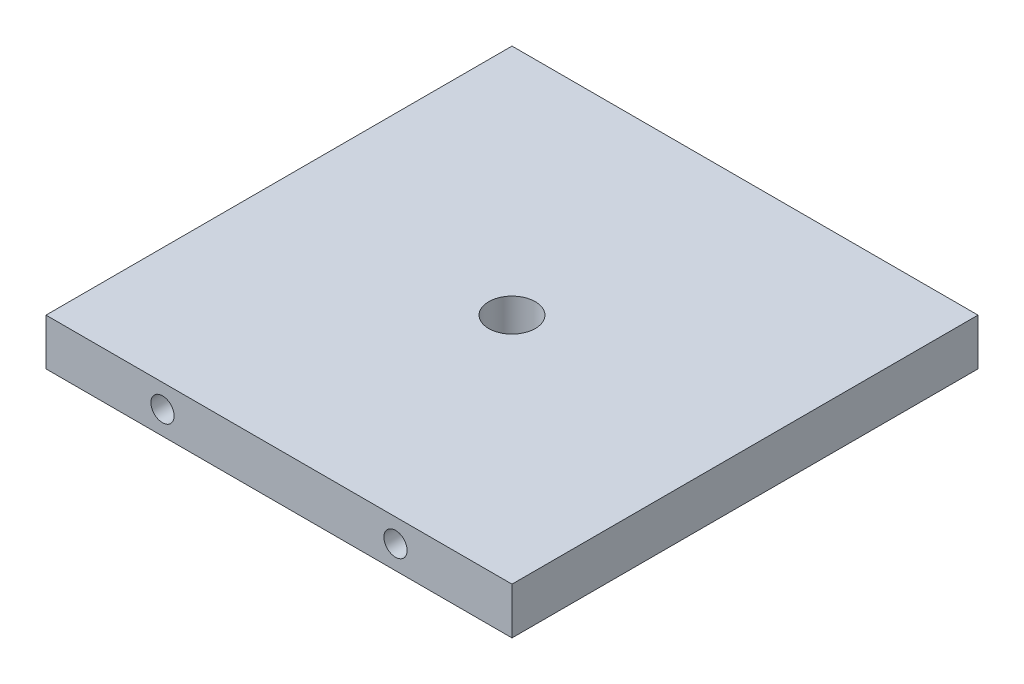
ISO-10303-21;
HEADER;
FILE_DESCRIPTION(('STEP AP214'),'2;1');
FILE_NAME('part.step','',(''),(''),'','','');
FILE_SCHEMA(('AUTOMOTIVE_DESIGN { 1 0 10303 214 1 1 1 1 }'));
ENDSEC;
DATA;
#1=APPLICATION_CONTEXT('core data for automotive mechanical design processes');
#2=APPLICATION_PROTOCOL_DEFINITION('international standard','automotive_design',2000,#1);
#3=PRODUCT_CONTEXT('',#1,'mechanical');
#4=PRODUCT('Part','Part','',(#3));
#5=PRODUCT_RELATED_PRODUCT_CATEGORY('part','',(#4));
#6=PRODUCT_DEFINITION_FORMATION('','',#4);
#7=PRODUCT_DEFINITION_CONTEXT('part definition',#1,'design');
#8=PRODUCT_DEFINITION('design','',#6,#7);
#9=PRODUCT_DEFINITION_SHAPE('','',#8);
#10=(LENGTH_UNIT() NAMED_UNIT(*) SI_UNIT(.MILLI.,.METRE.));
#11=(NAMED_UNIT(*) PLANE_ANGLE_UNIT() SI_UNIT($,.RADIAN.));
#12=(NAMED_UNIT(*) SI_UNIT($,.STERADIAN.) SOLID_ANGLE_UNIT());
#13=UNCERTAINTY_MEASURE_WITH_UNIT(LENGTH_MEASURE(1.E-05),#10,'distance_accuracy_value','');
#14=(GEOMETRIC_REPRESENTATION_CONTEXT(3) GLOBAL_UNCERTAINTY_ASSIGNED_CONTEXT((#13)) GLOBAL_UNIT_ASSIGNED_CONTEXT((#10,
#11,#12)) REPRESENTATION_CONTEXT('',''));
#15=CARTESIAN_POINT('',(0.,0.,0.));
#16=DIRECTION('',(0.,0.,1.));
#17=DIRECTION('',(1.,0.,0.));
#18=AXIS2_PLACEMENT_3D('',#15,#16,#17);
#19=CARTESIAN_POINT('',(50.,10.,50.));
#20=DIRECTION('',(-1.,0.,0.));
#21=DIRECTION('',(0.,0.,1.));
#22=AXIS2_PLACEMENT_3D('',#19,#20,#21);
#23=PLANE('',#22);
#24=DIRECTION('',(0.,0.,-1.));
#25=VECTOR('',#24,1.);
#26=CARTESIAN_POINT('',(50.,0.,50.));
#27=LINE('',#26,#25);
#28=CARTESIAN_POINT('',(50.,0.,50.));
#29=VERTEX_POINT('',#28);
#30=CARTESIAN_POINT('',(50.,0.,-50.));
#31=VERTEX_POINT('',#30);
#32=EDGE_CURVE('E98',#29,#31,#27,.T.);
#33=ORIENTED_EDGE('',*,*,#32,.T.);
#34=DIRECTION('',(0.,-1.,0.));
#35=VECTOR('',#34,1.);
#36=CARTESIAN_POINT('',(50.,10.,-50.));
#37=LINE('',#36,#35);
#38=CARTESIAN_POINT('',(50.,10.,-50.));
#39=VERTEX_POINT('',#38);
#40=EDGE_CURVE('E11',#39,#31,#37,.T.);
#41=ORIENTED_EDGE('',*,*,#40,.F.);
#42=DIRECTION('',(0.,0.,-1.));
#43=VECTOR('',#42,1.);
#44=CARTESIAN_POINT('',(50.,10.,50.));
#45=LINE('',#44,#43);
#46=CARTESIAN_POINT('',(50.,10.,50.));
#47=VERTEX_POINT('',#46);
#48=EDGE_CURVE('E86',#47,#39,#45,.T.);
#49=ORIENTED_EDGE('',*,*,#48,.F.);
#50=DIRECTION('',(0.,-1.,0.));
#51=VECTOR('',#50,1.);
#52=CARTESIAN_POINT('',(50.,10.,50.));
#53=LINE('',#52,#51);
#54=EDGE_CURVE('E94',#47,#29,#53,.T.);
#55=ORIENTED_EDGE('',*,*,#54,.T.);
#56=EDGE_LOOP('',(#33,#41,#49,#55));
#57=FACE_BOUND('',#56,.T.);
#58=ADVANCED_FACE('F35',(#57),#23,.F.);
#59=CARTESIAN_POINT('',(-50.,10.,-50.));
#60=DIRECTION('',(0.,0.,1.));
#61=DIRECTION('',(1.,0.,0.));
#62=AXIS2_PLACEMENT_3D('',#59,#60,#61);
#63=PLANE('',#62);
#64=CARTESIAN_POINT('',(-25.,5.,-50.));
#65=DIRECTION('',(0.,0.,-1.));
#66=DIRECTION('',(-1.,0.,0.));
#67=AXIS2_PLACEMENT_3D('',#64,#65,#66);
#68=CIRCLE('',#67,2.5);
#69=CARTESIAN_POINT('',(-27.5,5.,-50.));
#70=VERTEX_POINT('',#69);
#71=EDGE_CURVE('E130',#70,#70,#68,.T.);
#72=ORIENTED_EDGE('',*,*,#71,.F.);
#73=EDGE_LOOP('',(#72));
#74=FACE_BOUND('',#73,.T.);
#75=CARTESIAN_POINT('',(25.,5.,-50.));
#76=DIRECTION('',(0.,0.,-1.));
#77=DIRECTION('',(-1.,0.,0.));
#78=AXIS2_PLACEMENT_3D('',#75,#76,#77);
#79=CIRCLE('',#78,2.5);
#80=CARTESIAN_POINT('',(22.5,5.,-50.));
#81=VERTEX_POINT('',#80);
#82=EDGE_CURVE('E124',#81,#81,#79,.T.);
#83=ORIENTED_EDGE('',*,*,#82,.F.);
#84=EDGE_LOOP('',(#83));
#85=FACE_BOUND('',#84,.T.);
#86=DIRECTION('',(-1.,0.,0.));
#87=VECTOR('',#86,1.);
#88=CARTESIAN_POINT('',(-50.,0.,-50.));
#89=LINE('',#88,#87);
#90=CARTESIAN_POINT('',(-50.,0.,-50.));
#91=VERTEX_POINT('',#90);
#92=EDGE_CURVE('E90',#31,#91,#89,.T.);
#93=ORIENTED_EDGE('',*,*,#92,.T.);
#94=DIRECTION('',(0.,-1.,0.));
#95=VECTOR('',#94,1.);
#96=CARTESIAN_POINT('',(-50.,10.,-50.));
#97=LINE('',#96,#95);
#98=CARTESIAN_POINT('',(-50.,10.,-50.));
#99=VERTEX_POINT('',#98);
#100=EDGE_CURVE('E43',#99,#91,#97,.T.);
#101=ORIENTED_EDGE('',*,*,#100,.F.);
#102=DIRECTION('',(-1.,0.,0.));
#103=VECTOR('',#102,1.);
#104=CARTESIAN_POINT('',(-50.,10.,-50.));
#105=LINE('',#104,#103);
#106=EDGE_CURVE('E81',#39,#99,#105,.T.);
#107=ORIENTED_EDGE('',*,*,#106,.F.);
#108=ORIENTED_EDGE('',*,*,#40,.T.);
#109=EDGE_LOOP('',(#93,#101,#107,#108));
#110=FACE_BOUND('',#109,.T.);
#111=ADVANCED_FACE('F89',(#74,#85,#110),#63,.F.);
#112=CARTESIAN_POINT('',(-50.,10.,50.));
#113=DIRECTION('',(1.,0.,0.));
#114=DIRECTION('',(0.,0.,-1.));
#115=AXIS2_PLACEMENT_3D('',#112,#113,#114);
#116=PLANE('',#115);
#117=DIRECTION('',(0.,0.,1.));
#118=VECTOR('',#117,1.);
#119=CARTESIAN_POINT('',(-50.,0.,50.));
#120=LINE('',#119,#118);
#121=CARTESIAN_POINT('',(-50.,0.,50.));
#122=VERTEX_POINT('',#121);
#123=EDGE_CURVE('E68',#91,#122,#120,.T.);
#124=ORIENTED_EDGE('',*,*,#123,.T.);
#125=DIRECTION('',(0.,-1.,0.));
#126=VECTOR('',#125,1.);
#127=CARTESIAN_POINT('',(-50.,10.,50.));
#128=LINE('',#127,#126);
#129=CARTESIAN_POINT('',(-50.,10.,50.));
#130=VERTEX_POINT('',#129);
#131=EDGE_CURVE('E91',#130,#122,#128,.T.);
#132=ORIENTED_EDGE('',*,*,#131,.F.);
#133=DIRECTION('',(0.,0.,1.));
#134=VECTOR('',#133,1.);
#135=CARTESIAN_POINT('',(-50.,10.,50.));
#136=LINE('',#135,#134);
#137=EDGE_CURVE('E84',#99,#130,#136,.T.);
#138=ORIENTED_EDGE('',*,*,#137,.F.);
#139=ORIENTED_EDGE('',*,*,#100,.T.);
#140=EDGE_LOOP('',(#124,#132,#138,#139));
#141=FACE_BOUND('',#140,.T.);
#142=ADVANCED_FACE('F92',(#141),#116,.F.);
#143=CARTESIAN_POINT('',(-50.,10.,50.));
#144=DIRECTION('',(0.,0.,-1.));
#145=DIRECTION('',(-1.,0.,0.));
#146=AXIS2_PLACEMENT_3D('',#143,#144,#145);
#147=PLANE('',#146);
#148=CARTESIAN_POINT('',(25.,5.,50.));
#149=DIRECTION('',(0.,0.,1.));
#150=DIRECTION('',(1.,0.,0.));
#151=AXIS2_PLACEMENT_3D('',#148,#149,#150);
#152=CIRCLE('',#151,2.5);
#153=CARTESIAN_POINT('',(27.5,5.,50.));
#154=VERTEX_POINT('',#153);
#155=EDGE_CURVE('E118',#154,#154,#152,.T.);
#156=ORIENTED_EDGE('',*,*,#155,.F.);
#157=EDGE_LOOP('',(#156));
#158=FACE_BOUND('',#157,.T.);
#159=CARTESIAN_POINT('',(-25.,5.,50.));
#160=DIRECTION('',(0.,0.,1.));
#161=DIRECTION('',(1.,0.,0.));
#162=AXIS2_PLACEMENT_3D('',#159,#160,#161);
#163=CIRCLE('',#162,2.5);
#164=CARTESIAN_POINT('',(-22.5,5.,50.));
#165=VERTEX_POINT('',#164);
#166=EDGE_CURVE('E112',#165,#165,#163,.T.);
#167=ORIENTED_EDGE('',*,*,#166,.F.);
#168=EDGE_LOOP('',(#167));
#169=FACE_BOUND('',#168,.T.);
#170=DIRECTION('',(1.,0.,0.));
#171=VECTOR('',#170,1.);
#172=CARTESIAN_POINT('',(-50.,0.,50.));
#173=LINE('',#172,#171);
#174=EDGE_CURVE('E74',#122,#29,#173,.T.);
#175=ORIENTED_EDGE('',*,*,#174,.T.);
#176=ORIENTED_EDGE('',*,*,#54,.F.);
#177=DIRECTION('',(1.,0.,0.));
#178=VECTOR('',#177,1.);
#179=CARTESIAN_POINT('',(-50.,10.,50.));
#180=LINE('',#179,#178);
#181=EDGE_CURVE('E51',#130,#47,#180,.T.);
#182=ORIENTED_EDGE('',*,*,#181,.F.);
#183=ORIENTED_EDGE('',*,*,#131,.T.);
#184=EDGE_LOOP('',(#175,#176,#182,#183));
#185=FACE_BOUND('',#184,.T.);
#186=ADVANCED_FACE('F106',(#158,#169,#185),#147,.F.);
#187=CARTESIAN_POINT('',(0.,10.,0.));
#188=DIRECTION('',(0.,-1.,0.));
#189=DIRECTION('',(0.,0.,-1.));
#190=AXIS2_PLACEMENT_3D('',#187,#188,#189);
#191=PLANE('',#190);
#192=CARTESIAN_POINT('',(0.,10.,0.));
#193=DIRECTION('',(0.,1.,0.));
#194=DIRECTION('',(0.,0.,1.));
#195=AXIS2_PLACEMENT_3D('',#192,#193,#194);
#196=CIRCLE('',#195,5.);
#197=CARTESIAN_POINT('',(0.,10.,5.));
#198=VERTEX_POINT('',#197);
#199=EDGE_CURVE('E136',#198,#198,#196,.T.);
#200=ORIENTED_EDGE('',*,*,#199,.F.);
#201=EDGE_LOOP('',(#200));
#202=FACE_BOUND('',#201,.T.);
#203=ORIENTED_EDGE('',*,*,#48,.T.);
#204=ORIENTED_EDGE('',*,*,#106,.T.);
#205=ORIENTED_EDGE('',*,*,#137,.T.);
#206=ORIENTED_EDGE('',*,*,#181,.T.);
#207=EDGE_LOOP('',(#203,#204,#205,#206));
#208=FACE_BOUND('',#207,.T.);
#209=ADVANCED_FACE('F82',(#202,#208),#191,.F.);
#210=CARTESIAN_POINT('',(0.,0.,0.));
#211=DIRECTION('',(0.,-1.,0.));
#212=DIRECTION('',(0.,0.,-1.));
#213=AXIS2_PLACEMENT_3D('',#210,#211,#212);
#214=PLANE('',#213);
#215=CARTESIAN_POINT('',(0.,0.,0.));
#216=DIRECTION('',(0.,1.,0.));
#217=DIRECTION('',(0.,0.,1.));
#218=AXIS2_PLACEMENT_3D('',#215,#216,#217);
#219=CIRCLE('',#218,5.);
#220=CARTESIAN_POINT('',(0.,0.,5.));
#221=VERTEX_POINT('',#220);
#222=EDGE_CURVE('E133',#221,#221,#219,.T.);
#223=ORIENTED_EDGE('',*,*,#222,.T.);
#224=EDGE_LOOP('',(#223));
#225=FACE_BOUND('',#224,.T.);
#226=ORIENTED_EDGE('',*,*,#32,.F.);
#227=ORIENTED_EDGE('',*,*,#174,.F.);
#228=ORIENTED_EDGE('',*,*,#123,.F.);
#229=ORIENTED_EDGE('',*,*,#92,.F.);
#230=EDGE_LOOP('',(#226,#227,#228,#229));
#231=FACE_BOUND('',#230,.T.);
#232=ADVANCED_FACE('F109',(#225,#231),#214,.T.);
#233=CARTESIAN_POINT('',(-25.,5.,40.));
#234=DIRECTION('',(0.,0.,1.));
#235=DIRECTION('',(1.,0.,0.));
#236=AXIS2_PLACEMENT_3D('',#233,#234,#235);
#237=CYLINDRICAL_SURFACE('',#236,2.5);
#238=CARTESIAN_POINT('',(-25.,5.,40.));
#239=DIRECTION('',(0.,0.,1.));
#240=DIRECTION('',(1.,0.,0.));
#241=AXIS2_PLACEMENT_3D('',#238,#239,#240);
#242=CIRCLE('',#241,2.5);
#243=CARTESIAN_POINT('',(-22.5,5.,40.));
#244=VERTEX_POINT('',#243);
#245=EDGE_CURVE('E101',#244,#244,#242,.T.);
#246=ORIENTED_EDGE('',*,*,#245,.F.);
#247=EDGE_LOOP('',(#246));
#248=FACE_BOUND('',#247,.T.);
#249=ORIENTED_EDGE('',*,*,#166,.T.);
#250=EDGE_LOOP('',(#249));
#251=FACE_BOUND('',#250,.T.);
#252=ADVANCED_FACE('F156',(#248,#251),#237,.F.);
#253=CARTESIAN_POINT('',(-25.,5.,40.));
#254=DIRECTION('',(0.,0.,1.));
#255=DIRECTION('',(1.,0.,0.));
#256=AXIS2_PLACEMENT_3D('',#253,#254,#255);
#257=PLANE('',#256);
#258=ORIENTED_EDGE('',*,*,#245,.T.);
#259=EDGE_LOOP('',(#258));
#260=FACE_BOUND('',#259,.T.);
#261=ADVANCED_FACE('F196',(#260),#257,.T.);
#262=CARTESIAN_POINT('',(25.,5.,40.));
#263=DIRECTION('',(0.,0.,1.));
#264=DIRECTION('',(1.,0.,0.));
#265=AXIS2_PLACEMENT_3D('',#262,#263,#264);
#266=CYLINDRICAL_SURFACE('',#265,2.5);
#267=CARTESIAN_POINT('',(25.,5.,40.));
#268=DIRECTION('',(0.,0.,1.));
#269=DIRECTION('',(1.,0.,0.));
#270=AXIS2_PLACEMENT_3D('',#267,#268,#269);
#271=CIRCLE('',#270,2.5);
#272=CARTESIAN_POINT('',(27.5,5.,40.));
#273=VERTEX_POINT('',#272);
#274=EDGE_CURVE('E115',#273,#273,#271,.T.);
#275=ORIENTED_EDGE('',*,*,#274,.F.);
#276=EDGE_LOOP('',(#275));
#277=FACE_BOUND('',#276,.T.);
#278=ORIENTED_EDGE('',*,*,#155,.T.);
#279=EDGE_LOOP('',(#278));
#280=FACE_BOUND('',#279,.T.);
#281=ADVANCED_FACE('F188',(#277,#280),#266,.F.);
#282=CARTESIAN_POINT('',(25.,5.,40.));
#283=DIRECTION('',(0.,0.,1.));
#284=DIRECTION('',(1.,0.,0.));
#285=AXIS2_PLACEMENT_3D('',#282,#283,#284);
#286=PLANE('',#285);
#287=ORIENTED_EDGE('',*,*,#274,.T.);
#288=EDGE_LOOP('',(#287));
#289=FACE_BOUND('',#288,.T.);
#290=ADVANCED_FACE('F178',(#289),#286,.T.);
#291=CARTESIAN_POINT('',(25.,5.,-40.));
#292=DIRECTION('',(0.,0.,-1.));
#293=DIRECTION('',(-1.,0.,0.));
#294=AXIS2_PLACEMENT_3D('',#291,#292,#293);
#295=CYLINDRICAL_SURFACE('',#294,2.5);
#296=CARTESIAN_POINT('',(25.,5.,-40.));
#297=DIRECTION('',(0.,0.,-1.));
#298=DIRECTION('',(-1.,0.,0.));
#299=AXIS2_PLACEMENT_3D('',#296,#297,#298);
#300=CIRCLE('',#299,2.5);
#301=CARTESIAN_POINT('',(22.5,5.,-40.));
#302=VERTEX_POINT('',#301);
#303=EDGE_CURVE('E121',#302,#302,#300,.T.);
#304=ORIENTED_EDGE('',*,*,#303,.F.);
#305=EDGE_LOOP('',(#304));
#306=FACE_BOUND('',#305,.T.);
#307=ORIENTED_EDGE('',*,*,#82,.T.);
#308=EDGE_LOOP('',(#307));
#309=FACE_BOUND('',#308,.T.);
#310=ADVANCED_FACE('F175',(#306,#309),#295,.F.);
#311=CARTESIAN_POINT('',(25.,5.,-40.));
#312=DIRECTION('',(0.,0.,-1.));
#313=DIRECTION('',(-1.,0.,0.));
#314=AXIS2_PLACEMENT_3D('',#311,#312,#313);
#315=PLANE('',#314);
#316=ORIENTED_EDGE('',*,*,#303,.T.);
#317=EDGE_LOOP('',(#316));
#318=FACE_BOUND('',#317,.T.);
#319=ADVANCED_FACE('F177',(#318),#315,.T.);
#320=CARTESIAN_POINT('',(-25.,5.,-40.));
#321=DIRECTION('',(0.,0.,-1.));
#322=DIRECTION('',(-1.,0.,0.));
#323=AXIS2_PLACEMENT_3D('',#320,#321,#322);
#324=CYLINDRICAL_SURFACE('',#323,2.5);
#325=CARTESIAN_POINT('',(-25.,5.,-40.));
#326=DIRECTION('',(0.,0.,-1.));
#327=DIRECTION('',(-1.,0.,0.));
#328=AXIS2_PLACEMENT_3D('',#325,#326,#327);
#329=CIRCLE('',#328,2.5);
#330=CARTESIAN_POINT('',(-27.5,5.,-40.));
#331=VERTEX_POINT('',#330);
#332=EDGE_CURVE('E127',#331,#331,#329,.T.);
#333=ORIENTED_EDGE('',*,*,#332,.F.);
#334=EDGE_LOOP('',(#333));
#335=FACE_BOUND('',#334,.T.);
#336=ORIENTED_EDGE('',*,*,#71,.T.);
#337=EDGE_LOOP('',(#336));
#338=FACE_BOUND('',#337,.T.);
#339=ADVANCED_FACE('F185',(#335,#338),#324,.F.);
#340=CARTESIAN_POINT('',(-25.,5.,-40.));
#341=DIRECTION('',(0.,0.,-1.));
#342=DIRECTION('',(-1.,0.,0.));
#343=AXIS2_PLACEMENT_3D('',#340,#341,#342);
#344=PLANE('',#343);
#345=ORIENTED_EDGE('',*,*,#332,.T.);
#346=EDGE_LOOP('',(#345));
#347=FACE_BOUND('',#346,.T.);
#348=ADVANCED_FACE('F146',(#347),#344,.T.);
#349=CARTESIAN_POINT('',(0.,0.,0.));
#350=DIRECTION('',(0.,1.,0.));
#351=DIRECTION('',(0.,0.,1.));
#352=AXIS2_PLACEMENT_3D('',#349,#350,#351);
#353=CYLINDRICAL_SURFACE('',#352,5.);
#354=ORIENTED_EDGE('',*,*,#222,.F.);
#355=EDGE_LOOP('',(#354));
#356=FACE_BOUND('',#355,.T.);
#357=ORIENTED_EDGE('',*,*,#199,.T.);
#358=EDGE_LOOP('',(#357));
#359=FACE_BOUND('',#358,.T.);
#360=ADVANCED_FACE('F143',(#356,#359),#353,.F.);
#361=CLOSED_SHELL('',(#58,#111,#142,#186,#209,#232,#252,#261,#281,#290,#310,#319,#339,#348,#360));
#362=MANIFOLD_SOLID_BREP('B2',#361);
#363=ADVANCED_BREP_SHAPE_REPRESENTATION('',(#18,#362),#14);
#364=SHAPE_DEFINITION_REPRESENTATION(#9,#363);
ENDSEC;
END-ISO-10303-21;
